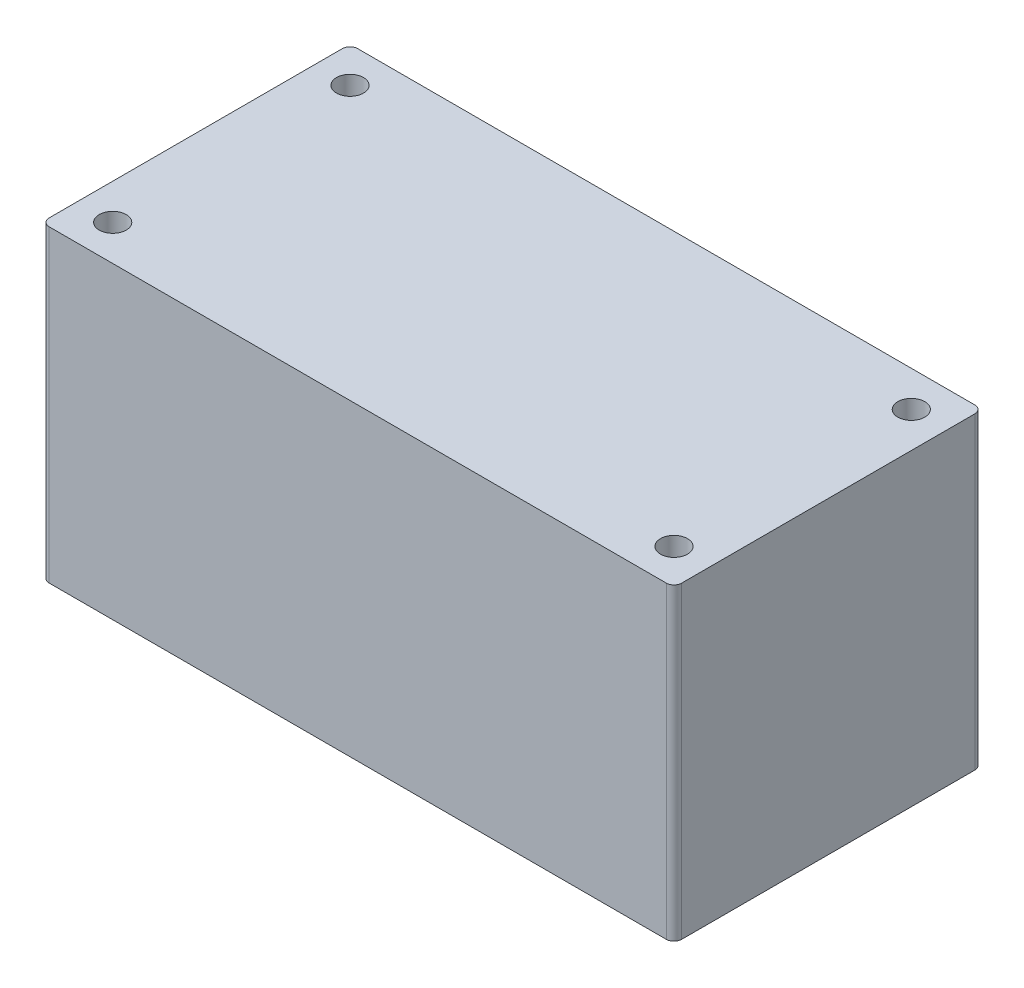
ISO-10303-21;
HEADER;
FILE_DESCRIPTION(('STEP AP214'),'2;1');
FILE_NAME('part.step','',(''),(''),'','','');
FILE_SCHEMA(('AUTOMOTIVE_DESIGN { 1 0 10303 214 1 1 1 1 }'));
ENDSEC;
DATA;
#1=APPLICATION_CONTEXT('core data for automotive mechanical design processes');
#2=APPLICATION_PROTOCOL_DEFINITION('international standard','automotive_design',2000,#1);
#3=PRODUCT_CONTEXT('',#1,'mechanical');
#4=PRODUCT('Part','Part','',(#3));
#5=PRODUCT_RELATED_PRODUCT_CATEGORY('part','',(#4));
#6=PRODUCT_DEFINITION_FORMATION('','',#4);
#7=PRODUCT_DEFINITION_CONTEXT('part definition',#1,'design');
#8=PRODUCT_DEFINITION('design','',#6,#7);
#9=PRODUCT_DEFINITION_SHAPE('','',#8);
#10=(LENGTH_UNIT() NAMED_UNIT(*) SI_UNIT(.MILLI.,.METRE.));
#11=(NAMED_UNIT(*) PLANE_ANGLE_UNIT() SI_UNIT($,.RADIAN.));
#12=(NAMED_UNIT(*) SI_UNIT($,.STERADIAN.) SOLID_ANGLE_UNIT());
#13=UNCERTAINTY_MEASURE_WITH_UNIT(LENGTH_MEASURE(1.E-05),#10,'distance_accuracy_value','');
#14=(GEOMETRIC_REPRESENTATION_CONTEXT(3) GLOBAL_UNCERTAINTY_ASSIGNED_CONTEXT((#13)) GLOBAL_UNIT_ASSIGNED_CONTEXT((#10,
#11,#12)) REPRESENTATION_CONTEXT('',''));
#15=CARTESIAN_POINT('',(0.,0.,0.));
#16=DIRECTION('',(0.,0.,1.));
#17=DIRECTION('',(1.,0.,0.));
#18=AXIS2_PLACEMENT_3D('',#15,#16,#17);
#19=CARTESIAN_POINT('',(20.5,20.,10.));
#20=DIRECTION('',(-1.,0.,0.));
#21=DIRECTION('',(0.,0.,1.));
#22=AXIS2_PLACEMENT_3D('',#19,#20,#21);
#23=PLANE('',#22);
#24=DIRECTION('',(0.,0.,-1.));
#25=VECTOR('',#24,1.);
#26=CARTESIAN_POINT('',(20.5,0.,10.));
#27=LINE('',#26,#25);
#28=CARTESIAN_POINT('',(20.5,0.,9.50000000000001));
#29=VERTEX_POINT('',#28);
#30=CARTESIAN_POINT('',(20.5,0.,-9.5));
#31=VERTEX_POINT('',#30);
#32=EDGE_CURVE('E127',#29,#31,#27,.T.);
#33=ORIENTED_EDGE('',*,*,#32,.T.);
#34=DIRECTION('',(0.,-1.,0.));
#35=VECTOR('',#34,1.);
#36=CARTESIAN_POINT('',(20.5,20.,-9.5));
#37=LINE('',#36,#35);
#38=CARTESIAN_POINT('',(20.5,20.,-9.5));
#39=VERTEX_POINT('',#38);
#40=EDGE_CURVE('E150',#31,#39,#37,.F.);
#41=ORIENTED_EDGE('',*,*,#40,.T.);
#42=DIRECTION('',(0.,0.,-1.));
#43=VECTOR('',#42,1.);
#44=CARTESIAN_POINT('',(20.5,20.,10.));
#45=LINE('',#44,#43);
#46=CARTESIAN_POINT('',(20.5,20.,9.50000000000001));
#47=VERTEX_POINT('',#46);
#48=EDGE_CURVE('E125',#47,#39,#45,.T.);
#49=ORIENTED_EDGE('',*,*,#48,.F.);
#50=DIRECTION('',(0.,-1.,0.));
#51=VECTOR('',#50,1.);
#52=CARTESIAN_POINT('',(20.5,20.,9.50000000000001));
#53=LINE('',#52,#51);
#54=EDGE_CURVE('E147',#47,#29,#53,.T.);
#55=ORIENTED_EDGE('',*,*,#54,.T.);
#56=EDGE_LOOP('',(#33,#41,#49,#55));
#57=FACE_BOUND('',#56,.T.);
#58=ADVANCED_FACE('F32',(#57),#23,.F.);
#59=CARTESIAN_POINT('',(-20.5,20.,-10.));
#60=DIRECTION('',(0.,0.,1.));
#61=DIRECTION('',(1.,0.,0.));
#62=AXIS2_PLACEMENT_3D('',#59,#60,#61);
#63=PLANE('',#62);
#64=DIRECTION('',(-1.,0.,0.));
#65=VECTOR('',#64,1.);
#66=CARTESIAN_POINT('',(-20.5,0.,-10.));
#67=LINE('',#66,#65);
#68=CARTESIAN_POINT('',(20.,0.,-10.));
#69=VERTEX_POINT('',#68);
#70=CARTESIAN_POINT('',(-20.,0.,-10.));
#71=VERTEX_POINT('',#70);
#72=EDGE_CURVE('E123',#69,#71,#67,.T.);
#73=ORIENTED_EDGE('',*,*,#72,.T.);
#74=DIRECTION('',(0.,-1.,0.));
#75=VECTOR('',#74,1.);
#76=CARTESIAN_POINT('',(-20.,20.,-10.));
#77=LINE('',#76,#75);
#78=CARTESIAN_POINT('',(-20.,20.,-10.));
#79=VERTEX_POINT('',#78);
#80=EDGE_CURVE('E102',#71,#79,#77,.F.);
#81=ORIENTED_EDGE('',*,*,#80,.T.);
#82=DIRECTION('',(-1.,0.,0.));
#83=VECTOR('',#82,1.);
#84=CARTESIAN_POINT('',(-20.5,20.,-10.));
#85=LINE('',#84,#83);
#86=CARTESIAN_POINT('',(20.,20.,-10.));
#87=VERTEX_POINT('',#86);
#88=EDGE_CURVE('E166',#87,#79,#85,.T.);
#89=ORIENTED_EDGE('',*,*,#88,.F.);
#90=DIRECTION('',(0.,-1.,0.));
#91=VECTOR('',#90,1.);
#92=CARTESIAN_POINT('',(20.,20.,-10.));
#93=LINE('',#92,#91);
#94=EDGE_CURVE('E107',#87,#69,#93,.T.);
#95=ORIENTED_EDGE('',*,*,#94,.T.);
#96=EDGE_LOOP('',(#73,#81,#89,#95));
#97=FACE_BOUND('',#96,.T.);
#98=ADVANCED_FACE('F218',(#97),#63,.F.);
#99=CARTESIAN_POINT('',(-20.5,20.,10.));
#100=DIRECTION('',(1.,0.,0.));
#101=DIRECTION('',(0.,0.,-1.));
#102=AXIS2_PLACEMENT_3D('',#99,#100,#101);
#103=PLANE('',#102);
#104=DIRECTION('',(0.,0.,1.));
#105=VECTOR('',#104,1.);
#106=CARTESIAN_POINT('',(-20.5,20.,10.));
#107=LINE('',#106,#105);
#108=CARTESIAN_POINT('',(-20.5,20.,-9.5));
#109=VERTEX_POINT('',#108);
#110=CARTESIAN_POINT('',(-20.5,20.,9.50000000000001));
#111=VERTEX_POINT('',#110);
#112=EDGE_CURVE('E116',#109,#111,#107,.T.);
#113=ORIENTED_EDGE('',*,*,#112,.F.);
#114=DIRECTION('',(0.,-1.,0.));
#115=VECTOR('',#114,1.);
#116=CARTESIAN_POINT('',(-20.5,20.,-9.5));
#117=LINE('',#116,#115);
#118=CARTESIAN_POINT('',(-20.5,0.,-9.5));
#119=VERTEX_POINT('',#118);
#120=EDGE_CURVE('E101',#109,#119,#117,.T.);
#121=ORIENTED_EDGE('',*,*,#120,.T.);
#122=DIRECTION('',(0.,0.,1.));
#123=VECTOR('',#122,1.);
#124=CARTESIAN_POINT('',(-20.5,0.,10.));
#125=LINE('',#124,#123);
#126=CARTESIAN_POINT('',(-20.5,0.,9.50000000000001));
#127=VERTEX_POINT('',#126);
#128=EDGE_CURVE('E114',#119,#127,#125,.T.);
#129=ORIENTED_EDGE('',*,*,#128,.T.);
#130=DIRECTION('',(0.,-1.,0.));
#131=VECTOR('',#130,1.);
#132=CARTESIAN_POINT('',(-20.5,20.,9.50000000000001));
#133=LINE('',#132,#131);
#134=EDGE_CURVE('E118',#127,#111,#133,.F.);
#135=ORIENTED_EDGE('',*,*,#134,.T.);
#136=EDGE_LOOP('',(#113,#121,#129,#135));
#137=FACE_BOUND('',#136,.T.);
#138=ADVANCED_FACE('F113',(#137),#103,.F.);
#139=CARTESIAN_POINT('',(-20.5,20.,10.));
#140=DIRECTION('',(0.,0.,-1.));
#141=DIRECTION('',(-1.,0.,0.));
#142=AXIS2_PLACEMENT_3D('',#139,#140,#141);
#143=PLANE('',#142);
#144=DIRECTION('',(1.,0.,0.));
#145=VECTOR('',#144,1.);
#146=CARTESIAN_POINT('',(-20.5,0.,10.));
#147=LINE('',#146,#145);
#148=CARTESIAN_POINT('',(-20.,0.,10.));
#149=VERTEX_POINT('',#148);
#150=CARTESIAN_POINT('',(20.,0.,10.));
#151=VERTEX_POINT('',#150);
#152=EDGE_CURVE('E122',#149,#151,#147,.T.);
#153=ORIENTED_EDGE('',*,*,#152,.T.);
#154=DIRECTION('',(0.,-1.,0.));
#155=VECTOR('',#154,1.);
#156=CARTESIAN_POINT('',(20.,20.,10.));
#157=LINE('',#156,#155);
#158=CARTESIAN_POINT('',(20.,20.,10.));
#159=VERTEX_POINT('',#158);
#160=EDGE_CURVE('E11',#151,#159,#157,.F.);
#161=ORIENTED_EDGE('',*,*,#160,.T.);
#162=DIRECTION('',(1.,0.,0.));
#163=VECTOR('',#162,1.);
#164=CARTESIAN_POINT('',(-20.5,20.,10.));
#165=LINE('',#164,#163);
#166=CARTESIAN_POINT('',(-20.,20.,10.));
#167=VERTEX_POINT('',#166);
#168=EDGE_CURVE('E131',#167,#159,#165,.T.);
#169=ORIENTED_EDGE('',*,*,#168,.F.);
#170=DIRECTION('',(0.,-1.,0.));
#171=VECTOR('',#170,1.);
#172=CARTESIAN_POINT('',(-20.,20.,10.));
#173=LINE('',#172,#171);
#174=EDGE_CURVE('E40',#167,#149,#173,.T.);
#175=ORIENTED_EDGE('',*,*,#174,.T.);
#176=EDGE_LOOP('',(#153,#161,#169,#175));
#177=FACE_BOUND('',#176,.T.);
#178=ADVANCED_FACE('F153',(#177),#143,.F.);
#179=CARTESIAN_POINT('',(0.,20.,0.));
#180=DIRECTION('',(0.,-1.,0.));
#181=DIRECTION('',(0.,0.,-1.));
#182=AXIS2_PLACEMENT_3D('',#179,#180,#181);
#183=PLANE('',#182);
#184=CARTESIAN_POINT('',(18.1909090909091,20.,7.69090909090909));
#185=DIRECTION('',(0.,1.,0.));
#186=DIRECTION('',(0.,0.,1.));
#187=AXIS2_PLACEMENT_3D('',#184,#185,#186);
#188=CIRCLE('',#187,0.875000000000002);
#189=CARTESIAN_POINT('',(18.1909090909091,20.,8.56590909090909));
#190=VERTEX_POINT('',#189);
#191=EDGE_CURVE('E189',#190,#190,#188,.T.);
#192=ORIENTED_EDGE('',*,*,#191,.F.);
#193=EDGE_LOOP('',(#192));
#194=FACE_BOUND('',#193,.T.);
#195=CARTESIAN_POINT('',(-18.1909090909091,20.,-7.69090909090909));
#196=DIRECTION('',(0.,1.,0.));
#197=DIRECTION('',(0.,0.,1.));
#198=AXIS2_PLACEMENT_3D('',#195,#196,#197);
#199=CIRCLE('',#198,0.875000000000002);
#200=CARTESIAN_POINT('',(-18.1909090909091,20.,-6.81590909090909));
#201=VERTEX_POINT('',#200);
#202=EDGE_CURVE('E182',#201,#201,#199,.T.);
#203=ORIENTED_EDGE('',*,*,#202,.F.);
#204=EDGE_LOOP('',(#203));
#205=FACE_BOUND('',#204,.T.);
#206=CARTESIAN_POINT('',(-18.1909090909091,20.,7.69090909090909));
#207=DIRECTION('',(0.,1.,0.));
#208=DIRECTION('',(0.,0.,1.));
#209=AXIS2_PLACEMENT_3D('',#206,#207,#208);
#210=CIRCLE('',#209,0.875000000000002);
#211=CARTESIAN_POINT('',(-18.1909090909091,20.,8.56590909090909));
#212=VERTEX_POINT('',#211);
#213=EDGE_CURVE('E194',#212,#212,#210,.T.);
#214=ORIENTED_EDGE('',*,*,#213,.F.);
#215=EDGE_LOOP('',(#214));
#216=FACE_BOUND('',#215,.T.);
#217=CARTESIAN_POINT('',(18.1909090909091,20.,-7.69090909090909));
#218=DIRECTION('',(0.,1.,0.));
#219=DIRECTION('',(0.,0.,1.));
#220=AXIS2_PLACEMENT_3D('',#217,#218,#219);
#221=CIRCLE('',#220,0.875000000000002);
#222=CARTESIAN_POINT('',(18.1909090909091,20.,-6.81590909090909));
#223=VERTEX_POINT('',#222);
#224=EDGE_CURVE('E171',#223,#223,#221,.T.);
#225=ORIENTED_EDGE('',*,*,#224,.F.);
#226=EDGE_LOOP('',(#225));
#227=FACE_BOUND('',#226,.T.);
#228=ORIENTED_EDGE('',*,*,#88,.T.);
#229=CARTESIAN_POINT('',(-20.,20.,-9.5));
#230=DIRECTION('',(0.,-1.,0.));
#231=DIRECTION('',(0.,0.,-1.));
#232=AXIS2_PLACEMENT_3D('',#229,#230,#231);
#233=CIRCLE('',#232,0.5);
#234=EDGE_CURVE('E145',#79,#109,#233,.F.);
#235=ORIENTED_EDGE('',*,*,#234,.T.);
#236=ORIENTED_EDGE('',*,*,#112,.T.);
#237=CARTESIAN_POINT('',(-20.,20.,9.50000000000001));
#238=DIRECTION('',(0.,-1.,0.));
#239=DIRECTION('',(0.,0.,-1.));
#240=AXIS2_PLACEMENT_3D('',#237,#238,#239);
#241=CIRCLE('',#240,0.5);
#242=EDGE_CURVE('E52',#111,#167,#241,.F.);
#243=ORIENTED_EDGE('',*,*,#242,.T.);
#244=ORIENTED_EDGE('',*,*,#168,.T.);
#245=CARTESIAN_POINT('',(20.,20.,9.50000000000001));
#246=DIRECTION('',(0.,-1.,0.));
#247=DIRECTION('',(0.,0.,-1.));
#248=AXIS2_PLACEMENT_3D('',#245,#246,#247);
#249=CIRCLE('',#248,0.5);
#250=EDGE_CURVE('E141',#159,#47,#249,.F.);
#251=ORIENTED_EDGE('',*,*,#250,.T.);
#252=ORIENTED_EDGE('',*,*,#48,.T.);
#253=CARTESIAN_POINT('',(20.,20.,-9.5));
#254=DIRECTION('',(0.,-1.,0.));
#255=DIRECTION('',(0.,0.,-1.));
#256=AXIS2_PLACEMENT_3D('',#253,#254,#255);
#257=CIRCLE('',#256,0.5);
#258=EDGE_CURVE('E143',#39,#87,#257,.F.);
#259=ORIENTED_EDGE('',*,*,#258,.T.);
#260=EDGE_LOOP('',(#228,#235,#236,#243,#244,#251,#252,#259));
#261=FACE_BOUND('',#260,.T.);
#262=ADVANCED_FACE('F209',(#194,#205,#216,#227,#261),#183,.F.);
#263=CARTESIAN_POINT('',(0.,0.,0.));
#264=DIRECTION('',(0.,-1.,0.));
#265=DIRECTION('',(0.,0.,-1.));
#266=AXIS2_PLACEMENT_3D('',#263,#264,#265);
#267=PLANE('',#266);
#268=CARTESIAN_POINT('',(18.1909090909091,0.,7.69090909090909));
#269=DIRECTION('',(0.,1.,0.));
#270=DIRECTION('',(0.,0.,1.));
#271=AXIS2_PLACEMENT_3D('',#268,#269,#270);
#272=CIRCLE('',#271,0.875000000000002);
#273=CARTESIAN_POINT('',(18.1909090909091,0.,8.56590909090909));
#274=VERTEX_POINT('',#273);
#275=EDGE_CURVE('E180',#274,#274,#272,.T.);
#276=ORIENTED_EDGE('',*,*,#275,.T.);
#277=EDGE_LOOP('',(#276));
#278=FACE_BOUND('',#277,.T.);
#279=CARTESIAN_POINT('',(-18.1909090909091,0.,-7.69090909090909));
#280=DIRECTION('',(0.,1.,0.));
#281=DIRECTION('',(0.,0.,1.));
#282=AXIS2_PLACEMENT_3D('',#279,#280,#281);
#283=CIRCLE('',#282,0.875000000000002);
#284=CARTESIAN_POINT('',(-18.1909090909091,0.,-6.81590909090909));
#285=VERTEX_POINT('',#284);
#286=EDGE_CURVE('E185',#285,#285,#283,.T.);
#287=ORIENTED_EDGE('',*,*,#286,.T.);
#288=EDGE_LOOP('',(#287));
#289=FACE_BOUND('',#288,.T.);
#290=CARTESIAN_POINT('',(-18.1909090909091,0.,7.69090909090909));
#291=DIRECTION('',(0.,1.,0.));
#292=DIRECTION('',(0.,0.,1.));
#293=AXIS2_PLACEMENT_3D('',#290,#291,#292);
#294=CIRCLE('',#293,0.875000000000002);
#295=CARTESIAN_POINT('',(-18.1909090909091,0.,8.56590909090909));
#296=VERTEX_POINT('',#295);
#297=EDGE_CURVE('E186',#296,#296,#294,.T.);
#298=ORIENTED_EDGE('',*,*,#297,.T.);
#299=EDGE_LOOP('',(#298));
#300=FACE_BOUND('',#299,.T.);
#301=CARTESIAN_POINT('',(18.1909090909091,0.,-7.69090909090909));
#302=DIRECTION('',(0.,1.,0.));
#303=DIRECTION('',(0.,0.,1.));
#304=AXIS2_PLACEMENT_3D('',#301,#302,#303);
#305=CIRCLE('',#304,0.875000000000002);
#306=CARTESIAN_POINT('',(18.1909090909091,0.,-6.81590909090909));
#307=VERTEX_POINT('',#306);
#308=EDGE_CURVE('E175',#307,#307,#305,.T.);
#309=ORIENTED_EDGE('',*,*,#308,.T.);
#310=EDGE_LOOP('',(#309));
#311=FACE_BOUND('',#310,.T.);
#312=ORIENTED_EDGE('',*,*,#128,.F.);
#313=CARTESIAN_POINT('',(-20.,0.,-9.5));
#314=DIRECTION('',(0.,-1.,0.));
#315=DIRECTION('',(0.,0.,-1.));
#316=AXIS2_PLACEMENT_3D('',#313,#314,#315);
#317=CIRCLE('',#316,0.5);
#318=EDGE_CURVE('E97',#119,#71,#317,.T.);
#319=ORIENTED_EDGE('',*,*,#318,.T.);
#320=ORIENTED_EDGE('',*,*,#72,.F.);
#321=CARTESIAN_POINT('',(20.,0.,-9.5));
#322=DIRECTION('',(0.,-1.,0.));
#323=DIRECTION('',(0.,0.,-1.));
#324=AXIS2_PLACEMENT_3D('',#321,#322,#323);
#325=CIRCLE('',#324,0.5);
#326=EDGE_CURVE('E108',#69,#31,#325,.T.);
#327=ORIENTED_EDGE('',*,*,#326,.T.);
#328=ORIENTED_EDGE('',*,*,#32,.F.);
#329=CARTESIAN_POINT('',(20.,0.,9.50000000000001));
#330=DIRECTION('',(0.,-1.,0.));
#331=DIRECTION('',(0.,0.,-1.));
#332=AXIS2_PLACEMENT_3D('',#329,#330,#331);
#333=CIRCLE('',#332,0.5);
#334=EDGE_CURVE('E134',#29,#151,#333,.T.);
#335=ORIENTED_EDGE('',*,*,#334,.T.);
#336=ORIENTED_EDGE('',*,*,#152,.F.);
#337=CARTESIAN_POINT('',(-20.,0.,9.50000000000001));
#338=DIRECTION('',(0.,-1.,0.));
#339=DIRECTION('',(0.,0.,-1.));
#340=AXIS2_PLACEMENT_3D('',#337,#338,#339);
#341=CIRCLE('',#340,0.5);
#342=EDGE_CURVE('E117',#149,#127,#341,.T.);
#343=ORIENTED_EDGE('',*,*,#342,.T.);
#344=EDGE_LOOP('',(#312,#319,#320,#327,#328,#335,#336,#343));
#345=FACE_BOUND('',#344,.T.);
#346=ADVANCED_FACE('F120',(#278,#289,#300,#311,#345),#267,.T.);
#347=CARTESIAN_POINT('',(-20.,20.,-9.5));
#348=DIRECTION('',(0.,-1.,0.));
#349=DIRECTION('',(0.,0.,-1.));
#350=AXIS2_PLACEMENT_3D('',#347,#348,#349);
#351=CYLINDRICAL_SURFACE('',#350,0.5);
#352=ORIENTED_EDGE('',*,*,#234,.F.);
#353=ORIENTED_EDGE('',*,*,#80,.F.);
#354=ORIENTED_EDGE('',*,*,#318,.F.);
#355=ORIENTED_EDGE('',*,*,#120,.F.);
#356=EDGE_LOOP('',(#352,#353,#354,#355));
#357=FACE_BOUND('',#356,.T.);
#358=ADVANCED_FACE('F100',(#357),#351,.T.);
#359=CARTESIAN_POINT('',(20.,20.,-9.5));
#360=DIRECTION('',(0.,-1.,0.));
#361=DIRECTION('',(0.,0.,-1.));
#362=AXIS2_PLACEMENT_3D('',#359,#360,#361);
#363=CYLINDRICAL_SURFACE('',#362,0.5);
#364=ORIENTED_EDGE('',*,*,#258,.F.);
#365=ORIENTED_EDGE('',*,*,#40,.F.);
#366=ORIENTED_EDGE('',*,*,#326,.F.);
#367=ORIENTED_EDGE('',*,*,#94,.F.);
#368=EDGE_LOOP('',(#364,#365,#366,#367));
#369=FACE_BOUND('',#368,.T.);
#370=ADVANCED_FACE('F220',(#369),#363,.T.);
#371=CARTESIAN_POINT('',(20.,20.,9.50000000000001));
#372=DIRECTION('',(0.,-1.,0.));
#373=DIRECTION('',(0.,0.,-1.));
#374=AXIS2_PLACEMENT_3D('',#371,#372,#373);
#375=CYLINDRICAL_SURFACE('',#374,0.5);
#376=ORIENTED_EDGE('',*,*,#250,.F.);
#377=ORIENTED_EDGE('',*,*,#160,.F.);
#378=ORIENTED_EDGE('',*,*,#334,.F.);
#379=ORIENTED_EDGE('',*,*,#54,.F.);
#380=EDGE_LOOP('',(#376,#377,#378,#379));
#381=FACE_BOUND('',#380,.T.);
#382=ADVANCED_FACE('F160',(#381),#375,.T.);
#383=CARTESIAN_POINT('',(-20.,20.,9.50000000000001));
#384=DIRECTION('',(0.,-1.,0.));
#385=DIRECTION('',(0.,0.,-1.));
#386=AXIS2_PLACEMENT_3D('',#383,#384,#385);
#387=CYLINDRICAL_SURFACE('',#386,0.5);
#388=ORIENTED_EDGE('',*,*,#242,.F.);
#389=ORIENTED_EDGE('',*,*,#134,.F.);
#390=ORIENTED_EDGE('',*,*,#342,.F.);
#391=ORIENTED_EDGE('',*,*,#174,.F.);
#392=EDGE_LOOP('',(#388,#389,#390,#391));
#393=FACE_BOUND('',#392,.T.);
#394=ADVANCED_FACE('F34',(#393),#387,.T.);
#395=CARTESIAN_POINT('',(18.1909090909091,0.,-7.69090909090909));
#396=DIRECTION('',(0.,1.,0.));
#397=DIRECTION('',(0.,0.,1.));
#398=AXIS2_PLACEMENT_3D('',#395,#396,#397);
#399=CYLINDRICAL_SURFACE('',#398,0.875000000000002);
#400=ORIENTED_EDGE('',*,*,#308,.F.);
#401=EDGE_LOOP('',(#400));
#402=FACE_BOUND('',#401,.T.);
#403=ORIENTED_EDGE('',*,*,#224,.T.);
#404=EDGE_LOOP('',(#403));
#405=FACE_BOUND('',#404,.T.);
#406=ADVANCED_FACE('F205',(#402,#405),#399,.F.);
#407=CARTESIAN_POINT('',(-18.1909090909091,0.,7.69090909090909));
#408=DIRECTION('',(0.,1.,0.));
#409=DIRECTION('',(0.,0.,1.));
#410=AXIS2_PLACEMENT_3D('',#407,#408,#409);
#411=CYLINDRICAL_SURFACE('',#410,0.875000000000002);
#412=ORIENTED_EDGE('',*,*,#297,.F.);
#413=EDGE_LOOP('',(#412));
#414=FACE_BOUND('',#413,.T.);
#415=ORIENTED_EDGE('',*,*,#213,.T.);
#416=EDGE_LOOP('',(#415));
#417=FACE_BOUND('',#416,.T.);
#418=ADVANCED_FACE('F201',(#414,#417),#411,.F.);
#419=CARTESIAN_POINT('',(-18.1909090909091,0.,-7.69090909090909));
#420=DIRECTION('',(0.,1.,0.));
#421=DIRECTION('',(0.,0.,1.));
#422=AXIS2_PLACEMENT_3D('',#419,#420,#421);
#423=CYLINDRICAL_SURFACE('',#422,0.875000000000002);
#424=ORIENTED_EDGE('',*,*,#286,.F.);
#425=EDGE_LOOP('',(#424));
#426=FACE_BOUND('',#425,.T.);
#427=ORIENTED_EDGE('',*,*,#202,.T.);
#428=EDGE_LOOP('',(#427));
#429=FACE_BOUND('',#428,.T.);
#430=ADVANCED_FACE('F204',(#426,#429),#423,.F.);
#431=CARTESIAN_POINT('',(18.1909090909091,0.,7.69090909090909));
#432=DIRECTION('',(0.,1.,0.));
#433=DIRECTION('',(0.,0.,1.));
#434=AXIS2_PLACEMENT_3D('',#431,#432,#433);
#435=CYLINDRICAL_SURFACE('',#434,0.875000000000002);
#436=ORIENTED_EDGE('',*,*,#275,.F.);
#437=EDGE_LOOP('',(#436));
#438=FACE_BOUND('',#437,.T.);
#439=ORIENTED_EDGE('',*,*,#191,.T.);
#440=EDGE_LOOP('',(#439));
#441=FACE_BOUND('',#440,.T.);
#442=ADVANCED_FACE('F247',(#438,#441),#435,.F.);
#443=CLOSED_SHELL('',(#58,#98,#138,#178,#262,#346,#358,#370,#382,#394,#406,#418,#430,#442));
#444=MANIFOLD_SOLID_BREP('B2',#443);
#445=ADVANCED_BREP_SHAPE_REPRESENTATION('',(#18,#444),#14);
#446=SHAPE_DEFINITION_REPRESENTATION(#9,#445);
ENDSEC;
END-ISO-10303-21;
